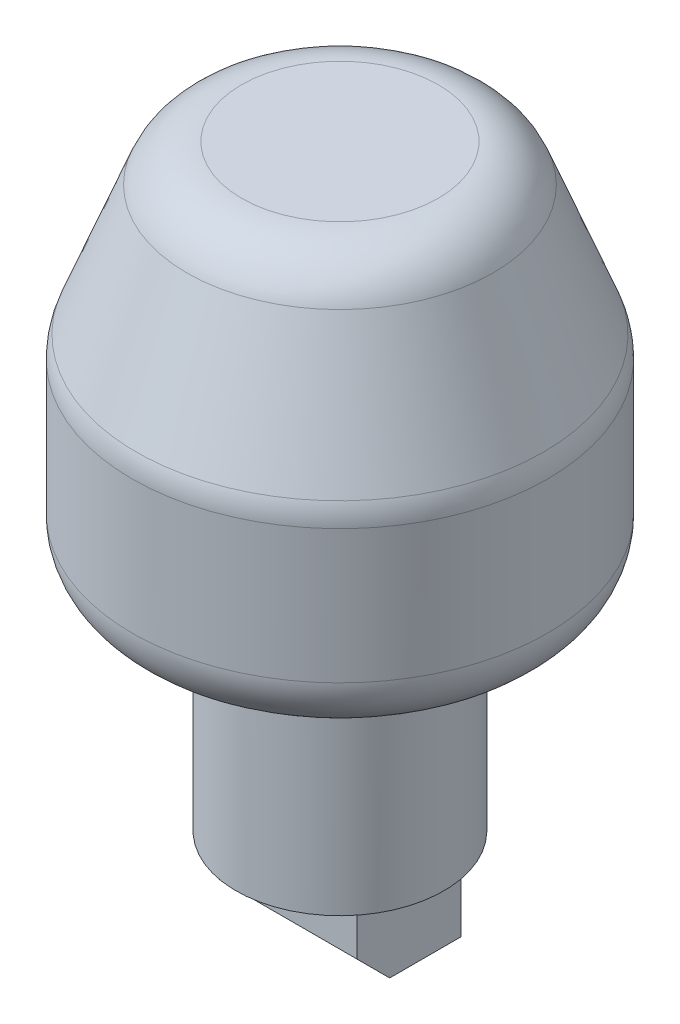
ISO-10303-21;
HEADER;
FILE_DESCRIPTION(('STEP AP214'),'2;1');
FILE_NAME('part.step','',(''),(''),'','','');
FILE_SCHEMA(('AUTOMOTIVE_DESIGN { 1 0 10303 214 1 1 1 1 }'));
ENDSEC;
DATA;
#1=APPLICATION_CONTEXT('core data for automotive mechanical design processes');
#2=APPLICATION_PROTOCOL_DEFINITION('international standard','automotive_design',2000,#1);
#3=PRODUCT_CONTEXT('',#1,'mechanical');
#4=PRODUCT('Part','Part','',(#3));
#5=PRODUCT_RELATED_PRODUCT_CATEGORY('part','',(#4));
#6=PRODUCT_DEFINITION_FORMATION('','',#4);
#7=PRODUCT_DEFINITION_CONTEXT('part definition',#1,'design');
#8=PRODUCT_DEFINITION('design','',#6,#7);
#9=PRODUCT_DEFINITION_SHAPE('','',#8);
#10=(LENGTH_UNIT() NAMED_UNIT(*) SI_UNIT(.MILLI.,.METRE.));
#11=(NAMED_UNIT(*) PLANE_ANGLE_UNIT() SI_UNIT($,.RADIAN.));
#12=(NAMED_UNIT(*) SI_UNIT($,.STERADIAN.) SOLID_ANGLE_UNIT());
#13=UNCERTAINTY_MEASURE_WITH_UNIT(LENGTH_MEASURE(1.E-05),#10,'distance_accuracy_value','');
#14=(GEOMETRIC_REPRESENTATION_CONTEXT(3) GLOBAL_UNCERTAINTY_ASSIGNED_CONTEXT((#13)) GLOBAL_UNIT_ASSIGNED_CONTEXT((#10,
#11,#12)) REPRESENTATION_CONTEXT('',''));
#15=CARTESIAN_POINT('',(0.,0.,0.));
#16=DIRECTION('',(0.,0.,1.));
#17=DIRECTION('',(1.,0.,0.));
#18=AXIS2_PLACEMENT_3D('',#15,#16,#17);
#19=CARTESIAN_POINT('',(7.4549,-9.01718142394338,0.));
#20=DIRECTION('',(0.,-1.,0.));
#21=DIRECTION('',(0.,0.,-1.));
#22=AXIS2_PLACEMENT_3D('',#19,#20,#21);
#23=PLANE('',#22);
#24=DIRECTION('',(0.,0.,1.));
#25=VECTOR('',#24,1.);
#26=CARTESIAN_POINT('',(7.3279,-9.01718142394338,0.));
#27=LINE('',#26,#25);
#28=CARTESIAN_POINT('',(7.3279,-9.01718142394338,-5.49919071197169));
#29=VERTEX_POINT('',#28);
#30=CARTESIAN_POINT('',(7.3279,-9.01718142394338,1.9430092880283));
#31=VERTEX_POINT('',#30);
#32=EDGE_CURVE('E59',#29,#31,#27,.T.);
#33=ORIENTED_EDGE('',*,*,#32,.F.);
#34=DIRECTION('',(1.,0.,0.));
#35=VECTOR('',#34,1.);
#36=CARTESIAN_POINT('',(0.,-9.01718142394338,-5.49919071197169));
#37=LINE('',#36,#35);
#38=CARTESIAN_POINT('',(2.54762,-9.01718142394338,-5.49919071197169));
#39=VERTEX_POINT('',#38);
#40=EDGE_CURVE('E210',#39,#29,#37,.T.);
#41=ORIENTED_EDGE('',*,*,#40,.F.);
#42=DIRECTION('',(0.,0.,-1.));
#43=VECTOR('',#42,1.);
#44=CARTESIAN_POINT('',(2.54762,-9.01718142394338,0.));
#45=LINE('',#44,#43);
#46=CARTESIAN_POINT('',(2.54762,-9.01718142394338,1.94300928802831));
#47=VERTEX_POINT('',#46);
#48=EDGE_CURVE('E225',#47,#39,#45,.T.);
#49=ORIENTED_EDGE('',*,*,#48,.F.);
#50=DIRECTION('',(-1.,0.,0.));
#51=VECTOR('',#50,1.);
#52=CARTESIAN_POINT('',(0.,-9.01718142394338,1.9430092880283));
#53=LINE('',#52,#51);
#54=EDGE_CURVE('E221',#31,#47,#53,.T.);
#55=ORIENTED_EDGE('',*,*,#54,.F.);
#56=EDGE_LOOP('',(#33,#41,#49,#55));
#57=FACE_BOUND('',#56,.T.);
#58=DIRECTION('',(-1.,0.,0.));
#59=VECTOR('',#58,1.);
#60=CARTESIAN_POINT('',(0.,-9.01718142394338,1.9430092880283));
#61=LINE('',#60,#59);
#62=CARTESIAN_POINT('',(-2.54762,-9.01718142394338,1.9430092880283));
#63=VERTEX_POINT('',#62);
#64=CARTESIAN_POINT('',(-7.3279,-9.01718142394338,1.9430092880283));
#65=VERTEX_POINT('',#64);
#66=EDGE_CURVE('E285',#63,#65,#61,.T.);
#67=ORIENTED_EDGE('',*,*,#66,.F.);
#68=DIRECTION('',(0.,0.,-1.));
#69=VECTOR('',#68,1.);
#70=CARTESIAN_POINT('',(-2.54762,-9.01718142394338,0.));
#71=LINE('',#70,#69);
#72=CARTESIAN_POINT('',(-2.54762,-9.01718142394338,-5.49919071197169));
#73=VERTEX_POINT('',#72);
#74=EDGE_CURVE('E263',#63,#73,#71,.T.);
#75=ORIENTED_EDGE('',*,*,#74,.T.);
#76=DIRECTION('',(1.,0.,0.));
#77=VECTOR('',#76,1.);
#78=CARTESIAN_POINT('',(0.,-9.01718142394338,-5.49919071197169));
#79=LINE('',#78,#77);
#80=CARTESIAN_POINT('',(-7.3279,-9.01718142394338,-5.49919071197169));
#81=VERTEX_POINT('',#80);
#82=EDGE_CURVE('E273',#81,#73,#79,.T.);
#83=ORIENTED_EDGE('',*,*,#82,.F.);
#84=DIRECTION('',(0.,0.,-1.));
#85=VECTOR('',#84,1.);
#86=CARTESIAN_POINT('',(-7.3279,-9.01718142394338,0.));
#87=LINE('',#86,#85);
#88=EDGE_CURVE('E288',#65,#81,#87,.T.);
#89=ORIENTED_EDGE('',*,*,#88,.F.);
#90=EDGE_LOOP('',(#67,#75,#83,#89));
#91=FACE_BOUND('',#90,.T.);
#92=DIRECTION('',(0.,0.,1.));
#93=VECTOR('',#92,1.);
#94=CARTESIAN_POINT('',(-7.4549,-9.01718142394338,0.));
#95=LINE('',#94,#93);
#96=CARTESIAN_POINT('',(-7.4549,-9.01718142394338,-5.6261907119717));
#97=VERTEX_POINT('',#96);
#98=CARTESIAN_POINT('',(-7.4549,-9.01718142394338,2.0700092880283));
#99=VERTEX_POINT('',#98);
#100=EDGE_CURVE('E323',#97,#99,#95,.T.);
#101=ORIENTED_EDGE('',*,*,#100,.F.);
#102=DIRECTION('',(-1.,0.,0.));
#103=VECTOR('',#102,1.);
#104=CARTESIAN_POINT('',(7.4549,-9.01718142394338,-5.6261907119717));
#105=LINE('',#104,#103);
#106=CARTESIAN_POINT('',(7.4549,-9.01718142394338,-5.6261907119717));
#107=VERTEX_POINT('',#106);
#108=EDGE_CURVE('E329',#107,#97,#105,.T.);
#109=ORIENTED_EDGE('',*,*,#108,.F.);
#110=DIRECTION('',(0.,0.,1.));
#111=VECTOR('',#110,1.);
#112=CARTESIAN_POINT('',(7.4549,-9.01718142394338,0.));
#113=LINE('',#112,#111);
#114=CARTESIAN_POINT('',(7.4549,-9.01718142394338,2.0700092880283));
#115=VERTEX_POINT('',#114);
#116=EDGE_CURVE('E309',#107,#115,#113,.T.);
#117=ORIENTED_EDGE('',*,*,#116,.T.);
#118=DIRECTION('',(-1.,0.,0.));
#119=VECTOR('',#118,1.);
#120=CARTESIAN_POINT('',(7.4549,-9.01718142394338,2.0700092880283));
#121=LINE('',#120,#119);
#122=EDGE_CURVE('E331',#115,#99,#121,.T.);
#123=ORIENTED_EDGE('',*,*,#122,.T.);
#124=EDGE_LOOP('',(#101,#109,#117,#123));
#125=FACE_BOUND('',#124,.T.);
#126=DIRECTION('',(-1.,0.,0.));
#127=VECTOR('',#126,1.);
#128=CARTESIAN_POINT('',(0.,-9.01718142394338,1.9430092880283));
#129=LINE('',#128,#127);
#130=CARTESIAN_POINT('',(2.42062,-9.01718142394338,1.9430092880283));
#131=VERTEX_POINT('',#130);
#132=CARTESIAN_POINT('',(-2.42062,-9.01718142394338,1.94300928802831));
#133=VERTEX_POINT('',#132);
#134=EDGE_CURVE('E253',#131,#133,#129,.T.);
#135=ORIENTED_EDGE('',*,*,#134,.F.);
#136=DIRECTION('',(0.,0.,-1.));
#137=VECTOR('',#136,1.);
#138=CARTESIAN_POINT('',(2.42062,-9.01718142394338,0.));
#139=LINE('',#138,#137);
#140=CARTESIAN_POINT('',(2.42062,-9.01718142394338,-5.49919071197169));
#141=VERTEX_POINT('',#140);
#142=EDGE_CURVE('E232',#131,#141,#139,.T.);
#143=ORIENTED_EDGE('',*,*,#142,.T.);
#144=DIRECTION('',(1.,0.,0.));
#145=VECTOR('',#144,1.);
#146=CARTESIAN_POINT('',(0.,-9.01718142394338,-5.49919071197169));
#147=LINE('',#146,#145);
#148=CARTESIAN_POINT('',(-2.42062,-9.01718142394338,-5.49919071197169));
#149=VERTEX_POINT('',#148);
#150=EDGE_CURVE('E241',#149,#141,#147,.T.);
#151=ORIENTED_EDGE('',*,*,#150,.F.);
#152=DIRECTION('',(0.,0.,-1.));
#153=VECTOR('',#152,1.);
#154=CARTESIAN_POINT('',(-2.42062,-9.01718142394338,0.));
#155=LINE('',#154,#153);
#156=EDGE_CURVE('E256',#133,#149,#155,.T.);
#157=ORIENTED_EDGE('',*,*,#156,.F.);
#158=EDGE_LOOP('',(#135,#143,#151,#157));
#159=FACE_BOUND('',#158,.T.);
#160=ADVANCED_FACE('F36',(#57,#91,#125,#159),#23,.T.);
#161=CARTESIAN_POINT('',(0.,0.,0.));
#162=DIRECTION('',(0.,1.,0.));
#163=DIRECTION('',(-1.,0.,0.));
#164=AXIS2_PLACEMENT_3D('',#161,#162,#163);
#165=PLANE('',#164);
#166=DIRECTION('',(-1.,0.,0.));
#167=VECTOR('',#166,1.);
#168=CARTESIAN_POINT('',(7.4549,0.,5.62619071197169));
#169=LINE('',#168,#167);
#170=CARTESIAN_POINT('',(7.4549,0.,5.62619071197169));
#171=VERTEX_POINT('',#170);
#172=CARTESIAN_POINT('',(-7.4549,0.,5.62619071197169));
#173=VERTEX_POINT('',#172);
#174=EDGE_CURVE('E336',#171,#173,#169,.T.);
#175=ORIENTED_EDGE('',*,*,#174,.F.);
#176=DIRECTION('',(0.,0.,-1.));
#177=VECTOR('',#176,1.);
#178=CARTESIAN_POINT('',(7.4549,0.,0.));
#179=LINE('',#178,#177);
#180=CARTESIAN_POINT('',(7.4549,0.,-5.62619071197169));
#181=VERTEX_POINT('',#180);
#182=EDGE_CURVE('E302',#171,#181,#179,.T.);
#183=ORIENTED_EDGE('',*,*,#182,.T.);
#184=DIRECTION('',(-1.,0.,0.));
#185=VECTOR('',#184,1.);
#186=CARTESIAN_POINT('',(7.4549,0.,-5.62619071197169));
#187=LINE('',#186,#185);
#188=CARTESIAN_POINT('',(-7.4549,0.,-5.62619071197169));
#189=VERTEX_POINT('',#188);
#190=EDGE_CURVE('E315',#181,#189,#187,.T.);
#191=ORIENTED_EDGE('',*,*,#190,.T.);
#192=DIRECTION('',(0.,0.,-1.));
#193=VECTOR('',#192,1.);
#194=CARTESIAN_POINT('',(-7.4549,0.,0.));
#195=LINE('',#194,#193);
#196=EDGE_CURVE('E295',#173,#189,#195,.T.);
#197=ORIENTED_EDGE('',*,*,#196,.F.);
#198=EDGE_LOOP('',(#175,#183,#191,#197));
#199=FACE_BOUND('',#198,.T.);
#200=CARTESIAN_POINT('',(0.,0.,0.));
#201=DIRECTION('',(0.,1.,0.));
#202=DIRECTION('',(-1.,0.,0.));
#203=AXIS2_PLACEMENT_3D('',#200,#201,#202);
#204=CIRCLE('',#203,11.2395);
#205=CARTESIAN_POINT('',(-11.2395,0.,0.));
#206=VERTEX_POINT('',#205);
#207=EDGE_CURVE('E341',#206,#206,#204,.T.);
#208=ORIENTED_EDGE('',*,*,#207,.F.);
#209=EDGE_LOOP('',(#208));
#210=FACE_BOUND('',#209,.T.);
#211=ADVANCED_FACE('F377',(#199,#210),#165,.F.);
#212=CARTESIAN_POINT('',(0.,64.6193127521161,0.));
#213=DIRECTION('',(0.,1.,0.));
#214=DIRECTION('',(-1.,0.,0.));
#215=AXIS2_PLACEMENT_3D('',#212,#213,#214);
#216=CYLINDRICAL_SURFACE('',#215,11.2395);
#217=CARTESIAN_POINT('',(0.,21.2344,0.));
#218=DIRECTION('',(0.,-1.,0.));
#219=DIRECTION('',(0.,0.,-1.));
#220=AXIS2_PLACEMENT_3D('',#217,#218,#219);
#221=CIRCLE('',#220,11.2395);
#222=CARTESIAN_POINT('',(-1.778,21.2344,11.0979762231679));
#223=VERTEX_POINT('',#222);
#224=CARTESIAN_POINT('',(1.778,21.2344,11.0979762231679));
#225=VERTEX_POINT('',#224);
#226=EDGE_CURVE('E183',#223,#225,#221,.F.);
#227=ORIENTED_EDGE('',*,*,#226,.F.);
#228=DIRECTION('',(0.,1.,0.));
#229=VECTOR('',#228,1.);
#230=CARTESIAN_POINT('',(-1.778,64.6193127521161,11.0979762231679));
#231=LINE('',#230,#229);
#232=CARTESIAN_POINT('',(-1.778,23.4188,11.0979762231679));
#233=VERTEX_POINT('',#232);
#234=EDGE_CURVE('E188',#233,#223,#231,.F.);
#235=ORIENTED_EDGE('',*,*,#234,.F.);
#236=CARTESIAN_POINT('',(0.,23.4188,0.));
#237=DIRECTION('',(0.,1.,0.));
#238=DIRECTION('',(-1.,0.,0.));
#239=AXIS2_PLACEMENT_3D('',#236,#237,#238);
#240=CIRCLE('',#239,11.2395);
#241=CARTESIAN_POINT('',(1.778,23.4188,11.0979762231679));
#242=VERTEX_POINT('',#241);
#243=EDGE_CURVE('E339',#242,#233,#240,.T.);
#244=ORIENTED_EDGE('',*,*,#243,.F.);
#245=DIRECTION('',(0.,1.,0.));
#246=VECTOR('',#245,1.);
#247=CARTESIAN_POINT('',(1.778,64.6193127521161,11.0979762231679));
#248=LINE('',#247,#246);
#249=EDGE_CURVE('E51',#225,#242,#248,.T.);
#250=ORIENTED_EDGE('',*,*,#249,.F.);
#251=EDGE_LOOP('',(#227,#235,#244,#250));
#252=FACE_BOUND('',#251,.T.);
#253=ORIENTED_EDGE('',*,*,#207,.T.);
#254=EDGE_LOOP('',(#253));
#255=FACE_BOUND('',#254,.T.);
#256=ADVANCED_FACE('F198',(#252,#255),#216,.T.);
#257=CARTESIAN_POINT('',(11.2395,23.4188,0.));
#258=DIRECTION('',(0.,1.,0.));
#259=DIRECTION('',(-1.,0.,0.));
#260=AXIS2_PLACEMENT_3D('',#257,#258,#259);
#261=PLANE('',#260);
#262=CARTESIAN_POINT('',(0.,23.4188,0.));
#263=DIRECTION('',(0.,1.,0.));
#264=DIRECTION('',(-1.,0.,0.));
#265=AXIS2_PLACEMENT_3D('',#262,#263,#264);
#266=CIRCLE('',#265,16.123370687632);
#267=CARTESIAN_POINT('',(-16.123370687632,23.4188,0.));
#268=VERTEX_POINT('',#267);
#269=EDGE_CURVE('E350',#268,#268,#266,.F.);
#270=ORIENTED_EDGE('',*,*,#269,.T.);
#271=EDGE_LOOP('',(#270));
#272=FACE_BOUND('',#271,.T.);
#273=ORIENTED_EDGE('',*,*,#243,.T.);
#274=DIRECTION('',(0.,0.,1.));
#275=VECTOR('',#274,1.);
#276=CARTESIAN_POINT('',(-1.778,23.4188,-22.474370687632));
#277=LINE('',#276,#275);
#278=CARTESIAN_POINT('',(-1.778,23.4188,14.29512));
#279=VERTEX_POINT('',#278);
#280=EDGE_CURVE('E193',#233,#279,#277,.T.);
#281=ORIENTED_EDGE('',*,*,#280,.T.);
#282=DIRECTION('',(-1.,0.,0.));
#283=VECTOR('',#282,1.);
#284=CARTESIAN_POINT('',(-1.778,23.4188,14.29512));
#285=LINE('',#284,#283);
#286=CARTESIAN_POINT('',(1.778,23.4188,14.29512));
#287=VERTEX_POINT('',#286);
#288=EDGE_CURVE('E799',#287,#279,#285,.T.);
#289=ORIENTED_EDGE('',*,*,#288,.F.);
#290=DIRECTION('',(0.,0.,1.));
#291=VECTOR('',#290,1.);
#292=CARTESIAN_POINT('',(1.778,23.4188,-22.474370687632));
#293=LINE('',#292,#291);
#294=EDGE_CURVE('E222',#242,#287,#293,.T.);
#295=ORIENTED_EDGE('',*,*,#294,.F.);
#296=EDGE_LOOP('',(#273,#281,#289,#295));
#297=FACE_BOUND('',#296,.T.);
#298=ADVANCED_FACE('F406',(#272,#297),#261,.F.);
#299=CARTESIAN_POINT('',(0.,64.6193127521161,0.));
#300=DIRECTION('',(0.,1.,0.));
#301=DIRECTION('',(-1.,0.,0.));
#302=AXIS2_PLACEMENT_3D('',#299,#300,#301);
#303=CYLINDRICAL_SURFACE('',#302,22.473370687632);
#304=CARTESIAN_POINT('',(0.,29.7688,0.));
#305=DIRECTION('',(0.,1.,0.));
#306=DIRECTION('',(-1.,0.,0.));
#307=AXIS2_PLACEMENT_3D('',#304,#305,#306);
#308=CIRCLE('',#307,22.473370687632);
#309=CARTESIAN_POINT('',(-22.473370687632,29.7688,0.));
#310=VERTEX_POINT('',#309);
#311=EDGE_CURVE('E347',#310,#310,#308,.T.);
#312=ORIENTED_EDGE('',*,*,#311,.T.);
#313=EDGE_LOOP('',(#312));
#314=FACE_BOUND('',#313,.T.);
#315=CARTESIAN_POINT('',(0.,44.2210933640308,0.));
#316=DIRECTION('',(0.,-1.,0.));
#317=DIRECTION('',(1.,0.,0.));
#318=AXIS2_PLACEMENT_3D('',#315,#316,#317);
#319=CIRCLE('',#318,22.473370687632);
#320=CARTESIAN_POINT('',(22.473370687632,44.2210933640308,0.));
#321=VERTEX_POINT('',#320);
#322=EDGE_CURVE('E344',#321,#321,#319,.T.);
#323=ORIENTED_EDGE('',*,*,#322,.T.);
#324=EDGE_LOOP('',(#323));
#325=FACE_BOUND('',#324,.T.);
#326=ADVANCED_FACE('F403',(#314,#325),#303,.T.);
#327=CARTESIAN_POINT('',(0.,45.4152,0.));
#328=DIRECTION('',(0.,-1.,0.));
#329=DIRECTION('',(1.,0.,0.));
#330=AXIS2_PLACEMENT_3D('',#327,#328,#329);
#331=CONICAL_SURFACE('',#330,22.473370687632,0.371755130674789);
#332=CARTESIAN_POINT('',(0.,46.5277386775342,0.));
#333=DIRECTION('',(0.,1.,0.));
#334=DIRECTION('',(-1.,0.,0.));
#335=AXIS2_PLACEMENT_3D('',#332,#333,#334);
#336=CIRCLE('',#335,22.0396099828003);
#337=CARTESIAN_POINT('',(-22.0396099828003,46.5277386775342,0.));
#338=VERTEX_POINT('',#337);
#339=EDGE_CURVE('E44',#338,#338,#336,.T.);
#340=ORIENTED_EDGE('',*,*,#339,.T.);
#341=EDGE_LOOP('',(#340));
#342=FACE_BOUND('',#341,.T.);
#343=CARTESIAN_POINT('',(0.,60.5759580656195,0.));
#344=DIRECTION('',(0.,1.,0.));
#345=DIRECTION('',(-1.,0.,0.));
#346=AXIS2_PLACEMENT_3D('',#343,#344,#345);
#347=CIRCLE('',#346,16.5624381177172);
#348=CARTESIAN_POINT('',(-16.5624381177172,60.5759580656195,0.));
#349=VERTEX_POINT('',#348);
#350=EDGE_CURVE('E353',#349,#349,#347,.F.);
#351=ORIENTED_EDGE('',*,*,#350,.T.);
#352=EDGE_LOOP('',(#351));
#353=FACE_BOUND('',#352,.T.);
#354=ADVANCED_FACE('F358',(#342,#353),#331,.T.);
#355=CARTESIAN_POINT('',(14.986,64.6193127521161,0.));
#356=DIRECTION('',(0.,-1.,0.));
#357=DIRECTION('',(1.,0.,0.));
#358=AXIS2_PLACEMENT_3D('',#355,#356,#357);
#359=PLANE('',#358);
#360=CARTESIAN_POINT('',(0.,64.6193127521161,0.));
#361=DIRECTION('',(0.,-1.,0.));
#362=DIRECTION('',(1.,0.,0.));
#363=AXIS2_PLACEMENT_3D('',#360,#361,#362);
#364=CIRCLE('',#363,10.6461988225489);
#365=CARTESIAN_POINT('',(10.6461988225489,64.6193127521161,0.));
#366=VERTEX_POINT('',#365);
#367=EDGE_CURVE('E11',#366,#366,#364,.F.);
#368=ORIENTED_EDGE('',*,*,#367,.T.);
#369=EDGE_LOOP('',(#368));
#370=FACE_BOUND('',#369,.T.);
#371=ADVANCED_FACE('F372',(#370),#359,.F.);
#372=CARTESIAN_POINT('',(0.,29.7688,0.));
#373=DIRECTION('',(0.,1.,0.));
#374=DIRECTION('',(-1.,0.,0.));
#375=AXIS2_PLACEMENT_3D('',#372,#373,#374);
#376=TOROIDAL_SURFACE('',#375,16.123370687632,6.35);
#377=ORIENTED_EDGE('',*,*,#269,.F.);
#378=EDGE_LOOP('',(#377));
#379=FACE_BOUND('',#378,.T.);
#380=ORIENTED_EDGE('',*,*,#311,.F.);
#381=EDGE_LOOP('',(#380));
#382=FACE_BOUND('',#381,.T.);
#383=ADVANCED_FACE('F363',(#379,#382),#376,.T.);
#384=CARTESIAN_POINT('',(0.,44.2210933640308,0.));
#385=DIRECTION('',(0.,-1.,0.));
#386=DIRECTION('',(1.,0.,0.));
#387=AXIS2_PLACEMENT_3D('',#384,#385,#386);
#388=TOROIDAL_SURFACE('',#387,16.123370687632,6.35);
#389=ORIENTED_EDGE('',*,*,#322,.F.);
#390=EDGE_LOOP('',(#389));
#391=FACE_BOUND('',#390,.T.);
#392=ORIENTED_EDGE('',*,*,#339,.F.);
#393=EDGE_LOOP('',(#392));
#394=FACE_BOUND('',#393,.T.);
#395=ADVANCED_FACE('F361',(#391,#394),#388,.T.);
#396=CARTESIAN_POINT('',(0.,58.2693127521161,0.));
#397=DIRECTION('',(0.,-1.,0.));
#398=DIRECTION('',(1.,0.,0.));
#399=AXIS2_PLACEMENT_3D('',#396,#397,#398);
#400=TOROIDAL_SURFACE('',#399,10.6461988225489,6.35);
#401=ORIENTED_EDGE('',*,*,#350,.F.);
#402=EDGE_LOOP('',(#401));
#403=FACE_BOUND('',#402,.T.);
#404=ORIENTED_EDGE('',*,*,#367,.F.);
#405=EDGE_LOOP('',(#404));
#406=FACE_BOUND('',#405,.T.);
#407=ADVANCED_FACE('F38',(#403,#406),#400,.T.);
#408=CARTESIAN_POINT('',(7.4549,0.,5.62619071197169));
#409=DIRECTION('',(0.,0.,-1.));
#410=DIRECTION('',(0.,1.,0.));
#411=AXIS2_PLACEMENT_3D('',#408,#409,#410);
#412=PLANE('',#411);
#413=DIRECTION('',(0.,-1.,0.));
#414=VECTOR('',#413,1.);
#415=CARTESIAN_POINT('',(-7.4549,0.,5.62619071197169));
#416=LINE('',#415,#414);
#417=CARTESIAN_POINT('',(-7.4549,-5.461,5.62619071197169));
#418=VERTEX_POINT('',#417);
#419=EDGE_CURVE('E318',#173,#418,#416,.T.);
#420=ORIENTED_EDGE('',*,*,#419,.T.);
#421=DIRECTION('',(-1.,0.,0.));
#422=VECTOR('',#421,1.);
#423=CARTESIAN_POINT('',(7.4549,-5.461,5.62619071197169));
#424=LINE('',#423,#422);
#425=CARTESIAN_POINT('',(7.4549,-5.461,5.62619071197169));
#426=VERTEX_POINT('',#425);
#427=EDGE_CURVE('E333',#426,#418,#424,.T.);
#428=ORIENTED_EDGE('',*,*,#427,.F.);
#429=DIRECTION('',(0.,-1.,0.));
#430=VECTOR('',#429,1.);
#431=CARTESIAN_POINT('',(7.4549,0.,5.62619071197169));
#432=LINE('',#431,#430);
#433=EDGE_CURVE('E304',#171,#426,#432,.T.);
#434=ORIENTED_EDGE('',*,*,#433,.F.);
#435=ORIENTED_EDGE('',*,*,#174,.T.);
#436=EDGE_LOOP('',(#420,#428,#434,#435));
#437=FACE_BOUND('',#436,.T.);
#438=ADVANCED_FACE('F369',(#437),#412,.F.);
#439=CARTESIAN_POINT('',(7.4549,-5.54359535598586,5.54359535598584));
#440=DIRECTION('',(0.,0.707106781186549,-0.707106781186546));
#441=DIRECTION('',(0.,0.707106781186546,0.707106781186549));
#442=AXIS2_PLACEMENT_3D('',#439,#440,#441);
#443=PLANE('',#442);
#444=DIRECTION('',(0.,-0.707106781186546,-0.707106781186549));
#445=VECTOR('',#444,1.);
#446=CARTESIAN_POINT('',(-7.4549,-5.54359535598586,5.54359535598584));
#447=LINE('',#446,#445);
#448=EDGE_CURVE('E320',#418,#99,#447,.T.);
#449=ORIENTED_EDGE('',*,*,#448,.T.);
#450=ORIENTED_EDGE('',*,*,#122,.F.);
#451=DIRECTION('',(0.,-0.707106781186546,-0.707106781186549));
#452=VECTOR('',#451,1.);
#453=CARTESIAN_POINT('',(7.4549,-5.54359535598586,5.54359535598584));
#454=LINE('',#453,#452);
#455=EDGE_CURVE('E307',#426,#115,#454,.T.);
#456=ORIENTED_EDGE('',*,*,#455,.F.);
#457=ORIENTED_EDGE('',*,*,#427,.T.);
#458=EDGE_LOOP('',(#449,#450,#456,#457));
#459=FACE_BOUND('',#458,.T.);
#460=ADVANCED_FACE('F391',(#459),#443,.F.);
#461=CARTESIAN_POINT('',(7.4549,0.,-5.62619071197169));
#462=DIRECTION('',(0.,0.,-1.));
#463=DIRECTION('',(0.,1.,0.));
#464=AXIS2_PLACEMENT_3D('',#461,#462,#463);
#465=PLANE('',#464);
#466=DIRECTION('',(0.,-1.,0.));
#467=VECTOR('',#466,1.);
#468=CARTESIAN_POINT('',(-7.4549,0.,-5.62619071197169));
#469=LINE('',#468,#467);
#470=EDGE_CURVE('E305',#189,#97,#469,.T.);
#471=ORIENTED_EDGE('',*,*,#470,.F.);
#472=ORIENTED_EDGE('',*,*,#190,.F.);
#473=DIRECTION('',(0.,-1.,0.));
#474=VECTOR('',#473,1.);
#475=CARTESIAN_POINT('',(7.4549,0.,-5.62619071197169));
#476=LINE('',#475,#474);
#477=EDGE_CURVE('E312',#181,#107,#476,.T.);
#478=ORIENTED_EDGE('',*,*,#477,.T.);
#479=ORIENTED_EDGE('',*,*,#108,.T.);
#480=EDGE_LOOP('',(#471,#472,#478,#479));
#481=FACE_BOUND('',#480,.T.);
#482=ADVANCED_FACE('F389',(#481),#465,.T.);
#483=CARTESIAN_POINT('',(7.4549,0.,0.));
#484=DIRECTION('',(1.,0.,0.));
#485=DIRECTION('',(0.,0.,-1.));
#486=AXIS2_PLACEMENT_3D('',#483,#484,#485);
#487=PLANE('',#486);
#488=ORIENTED_EDGE('',*,*,#182,.F.);
#489=ORIENTED_EDGE('',*,*,#433,.T.);
#490=ORIENTED_EDGE('',*,*,#455,.T.);
#491=ORIENTED_EDGE('',*,*,#116,.F.);
#492=ORIENTED_EDGE('',*,*,#477,.F.);
#493=EDGE_LOOP('',(#488,#489,#490,#491,#492));
#494=FACE_BOUND('',#493,.T.);
#495=ADVANCED_FACE('F426',(#494),#487,.T.);
#496=CARTESIAN_POINT('',(-7.4549,0.,0.));
#497=DIRECTION('',(1.,0.,0.));
#498=DIRECTION('',(0.,0.,-1.));
#499=AXIS2_PLACEMENT_3D('',#496,#497,#498);
#500=PLANE('',#499);
#501=ORIENTED_EDGE('',*,*,#196,.T.);
#502=ORIENTED_EDGE('',*,*,#470,.T.);
#503=ORIENTED_EDGE('',*,*,#100,.T.);
#504=ORIENTED_EDGE('',*,*,#448,.F.);
#505=ORIENTED_EDGE('',*,*,#419,.F.);
#506=EDGE_LOOP('',(#501,#502,#503,#504,#505));
#507=FACE_BOUND('',#506,.T.);
#508=ADVANCED_FACE('F430',(#507),#500,.F.);
#509=CARTESIAN_POINT('',(-2.54762,-6.47718142394338,0.));
#510=DIRECTION('',(-1.,0.,0.));
#511=DIRECTION('',(0.,0.,1.));
#512=AXIS2_PLACEMENT_3D('',#509,#510,#511);
#513=PLANE('',#512);
#514=ORIENTED_EDGE('',*,*,#74,.F.);
#515=DIRECTION('',(0.,-1.,0.));
#516=VECTOR('',#515,1.);
#517=CARTESIAN_POINT('',(-2.54762,-6.47718142394338,1.94300928802831));
#518=LINE('',#517,#516);
#519=CARTESIAN_POINT('',(-2.54762,-6.47718142394338,1.94300928802831));
#520=VERTEX_POINT('',#519);
#521=EDGE_CURVE('E282',#520,#63,#518,.T.);
#522=ORIENTED_EDGE('',*,*,#521,.F.);
#523=DIRECTION('',(0.,0.,-1.));
#524=VECTOR('',#523,1.);
#525=CARTESIAN_POINT('',(-2.54762,-6.47718142394338,0.));
#526=LINE('',#525,#524);
#527=CARTESIAN_POINT('',(-2.54762,-6.47718142394338,-5.49919071197169));
#528=VERTEX_POINT('',#527);
#529=EDGE_CURVE('E270',#520,#528,#526,.T.);
#530=ORIENTED_EDGE('',*,*,#529,.T.);
#531=DIRECTION('',(0.,-1.,0.));
#532=VECTOR('',#531,1.);
#533=CARTESIAN_POINT('',(-2.54762,-6.47718142394338,-5.49919071197169));
#534=LINE('',#533,#532);
#535=EDGE_CURVE('E293',#528,#73,#534,.T.);
#536=ORIENTED_EDGE('',*,*,#535,.T.);
#537=EDGE_LOOP('',(#514,#522,#530,#536));
#538=FACE_BOUND('',#537,.T.);
#539=ADVANCED_FACE('F444',(#538),#513,.T.);
#540=CARTESIAN_POINT('',(0.,-6.47718142394338,-5.49919071197169));
#541=DIRECTION('',(0.,0.,-1.));
#542=DIRECTION('',(0.,1.,0.));
#543=AXIS2_PLACEMENT_3D('',#540,#541,#542);
#544=PLANE('',#543);
#545=ORIENTED_EDGE('',*,*,#82,.T.);
#546=ORIENTED_EDGE('',*,*,#535,.F.);
#547=DIRECTION('',(1.,0.,0.));
#548=VECTOR('',#547,1.);
#549=CARTESIAN_POINT('',(0.,-6.47718142394338,-5.49919071197169));
#550=LINE('',#549,#548);
#551=CARTESIAN_POINT('',(-7.3279,-6.47718142394338,-5.49919071197169));
#552=VERTEX_POINT('',#551);
#553=EDGE_CURVE('E279',#552,#528,#550,.T.);
#554=ORIENTED_EDGE('',*,*,#553,.F.);
#555=DIRECTION('',(0.,-1.,0.));
#556=VECTOR('',#555,1.);
#557=CARTESIAN_POINT('',(-7.3279,-6.47718142394338,-5.49919071197169));
#558=LINE('',#557,#556);
#559=EDGE_CURVE('E296',#552,#81,#558,.T.);
#560=ORIENTED_EDGE('',*,*,#559,.T.);
#561=EDGE_LOOP('',(#545,#546,#554,#560));
#562=FACE_BOUND('',#561,.T.);
#563=ADVANCED_FACE('F652',(#562),#544,.F.);
#564=CARTESIAN_POINT('',(-7.3279,-6.47718142394338,0.));
#565=DIRECTION('',(-1.,0.,0.));
#566=DIRECTION('',(0.,0.,1.));
#567=AXIS2_PLACEMENT_3D('',#564,#565,#566);
#568=PLANE('',#567);
#569=ORIENTED_EDGE('',*,*,#88,.T.);
#570=ORIENTED_EDGE('',*,*,#559,.F.);
#571=DIRECTION('',(0.,0.,-1.));
#572=VECTOR('',#571,1.);
#573=CARTESIAN_POINT('',(-7.3279,-6.47718142394338,0.));
#574=LINE('',#573,#572);
#575=CARTESIAN_POINT('',(-7.3279,-6.47718142394338,1.94300928802831));
#576=VERTEX_POINT('',#575);
#577=EDGE_CURVE('E276',#576,#552,#574,.T.);
#578=ORIENTED_EDGE('',*,*,#577,.F.);
#579=DIRECTION('',(0.,-1.,0.));
#580=VECTOR('',#579,1.);
#581=CARTESIAN_POINT('',(-7.3279,-6.47718142394338,1.94300928802831));
#582=LINE('',#581,#580);
#583=EDGE_CURVE('E298',#576,#65,#582,.T.);
#584=ORIENTED_EDGE('',*,*,#583,.T.);
#585=EDGE_LOOP('',(#569,#570,#578,#584));
#586=FACE_BOUND('',#585,.T.);
#587=ADVANCED_FACE('F642',(#586),#568,.F.);
#588=CARTESIAN_POINT('',(0.,-6.47718142394338,1.94300928802831));
#589=DIRECTION('',(0.,0.,1.));
#590=DIRECTION('',(0.,-1.,0.));
#591=AXIS2_PLACEMENT_3D('',#588,#589,#590);
#592=PLANE('',#591);
#593=ORIENTED_EDGE('',*,*,#66,.T.);
#594=ORIENTED_EDGE('',*,*,#583,.F.);
#595=DIRECTION('',(-1.,0.,0.));
#596=VECTOR('',#595,1.);
#597=CARTESIAN_POINT('',(0.,-6.47718142394338,1.94300928802831));
#598=LINE('',#597,#596);
#599=EDGE_CURVE('E272',#520,#576,#598,.T.);
#600=ORIENTED_EDGE('',*,*,#599,.F.);
#601=ORIENTED_EDGE('',*,*,#521,.T.);
#602=EDGE_LOOP('',(#593,#594,#600,#601));
#603=FACE_BOUND('',#602,.T.);
#604=ADVANCED_FACE('F631',(#603),#592,.F.);
#605=CARTESIAN_POINT('',(0.,-6.47718142394338,0.));
#606=DIRECTION('',(0.,-1.,0.));
#607=DIRECTION('',(0.,0.,-1.));
#608=AXIS2_PLACEMENT_3D('',#605,#606,#607);
#609=PLANE('',#608);
#610=ORIENTED_EDGE('',*,*,#529,.F.);
#611=ORIENTED_EDGE('',*,*,#599,.T.);
#612=ORIENTED_EDGE('',*,*,#577,.T.);
#613=ORIENTED_EDGE('',*,*,#553,.T.);
#614=EDGE_LOOP('',(#610,#611,#612,#613));
#615=FACE_BOUND('',#614,.T.);
#616=ADVANCED_FACE('F619',(#615),#609,.T.);
#617=CARTESIAN_POINT('',(2.42062,-6.47718142394338,0.));
#618=DIRECTION('',(-1.,0.,0.));
#619=DIRECTION('',(0.,0.,1.));
#620=AXIS2_PLACEMENT_3D('',#617,#618,#619);
#621=PLANE('',#620);
#622=ORIENTED_EDGE('',*,*,#142,.F.);
#623=DIRECTION('',(0.,-1.,0.));
#624=VECTOR('',#623,1.);
#625=CARTESIAN_POINT('',(2.42062,-6.47718142394338,1.94300928802831));
#626=LINE('',#625,#624);
#627=CARTESIAN_POINT('',(2.42062,-6.47718142394338,1.94300928802831));
#628=VERTEX_POINT('',#627);
#629=EDGE_CURVE('E250',#628,#131,#626,.T.);
#630=ORIENTED_EDGE('',*,*,#629,.F.);
#631=DIRECTION('',(0.,0.,-1.));
#632=VECTOR('',#631,1.);
#633=CARTESIAN_POINT('',(2.42062,-6.47718142394338,0.));
#634=LINE('',#633,#632);
#635=CARTESIAN_POINT('',(2.42062,-6.47718142394338,-5.49919071197169));
#636=VERTEX_POINT('',#635);
#637=EDGE_CURVE('E238',#628,#636,#634,.T.);
#638=ORIENTED_EDGE('',*,*,#637,.T.);
#639=DIRECTION('',(0.,-1.,0.));
#640=VECTOR('',#639,1.);
#641=CARTESIAN_POINT('',(2.42062,-6.47718142394338,-5.49919071197169));
#642=LINE('',#641,#640);
#643=EDGE_CURVE('E261',#636,#141,#642,.T.);
#644=ORIENTED_EDGE('',*,*,#643,.T.);
#645=EDGE_LOOP('',(#622,#630,#638,#644));
#646=FACE_BOUND('',#645,.T.);
#647=ADVANCED_FACE('F609',(#646),#621,.T.);
#648=CARTESIAN_POINT('',(0.,-6.47718142394338,-5.49919071197169));
#649=DIRECTION('',(0.,0.,-1.));
#650=DIRECTION('',(0.,1.,0.));
#651=AXIS2_PLACEMENT_3D('',#648,#649,#650);
#652=PLANE('',#651);
#653=ORIENTED_EDGE('',*,*,#150,.T.);
#654=ORIENTED_EDGE('',*,*,#643,.F.);
#655=DIRECTION('',(1.,0.,0.));
#656=VECTOR('',#655,1.);
#657=CARTESIAN_POINT('',(0.,-6.47718142394338,-5.49919071197169));
#658=LINE('',#657,#656);
#659=CARTESIAN_POINT('',(-2.42062,-6.47718142394338,-5.49919071197169));
#660=VERTEX_POINT('',#659);
#661=EDGE_CURVE('E247',#660,#636,#658,.T.);
#662=ORIENTED_EDGE('',*,*,#661,.F.);
#663=DIRECTION('',(0.,-1.,0.));
#664=VECTOR('',#663,1.);
#665=CARTESIAN_POINT('',(-2.42062,-6.47718142394338,-5.49919071197169));
#666=LINE('',#665,#664);
#667=EDGE_CURVE('E264',#660,#149,#666,.T.);
#668=ORIENTED_EDGE('',*,*,#667,.T.);
#669=EDGE_LOOP('',(#653,#654,#662,#668));
#670=FACE_BOUND('',#669,.T.);
#671=ADVANCED_FACE('F599',(#670),#652,.F.);
#672=CARTESIAN_POINT('',(-2.42062,-6.47718142394338,0.));
#673=DIRECTION('',(-1.,0.,0.));
#674=DIRECTION('',(0.,0.,1.));
#675=AXIS2_PLACEMENT_3D('',#672,#673,#674);
#676=PLANE('',#675);
#677=ORIENTED_EDGE('',*,*,#156,.T.);
#678=ORIENTED_EDGE('',*,*,#667,.F.);
#679=DIRECTION('',(0.,0.,-1.));
#680=VECTOR('',#679,1.);
#681=CARTESIAN_POINT('',(-2.42062,-6.47718142394338,0.));
#682=LINE('',#681,#680);
#683=CARTESIAN_POINT('',(-2.42062,-6.47718142394338,1.94300928802831));
#684=VERTEX_POINT('',#683);
#685=EDGE_CURVE('E244',#684,#660,#682,.T.);
#686=ORIENTED_EDGE('',*,*,#685,.F.);
#687=DIRECTION('',(0.,-1.,0.));
#688=VECTOR('',#687,1.);
#689=CARTESIAN_POINT('',(-2.42062,-6.47718142394338,1.94300928802831));
#690=LINE('',#689,#688);
#691=EDGE_CURVE('E266',#684,#133,#690,.T.);
#692=ORIENTED_EDGE('',*,*,#691,.T.);
#693=EDGE_LOOP('',(#677,#678,#686,#692));
#694=FACE_BOUND('',#693,.T.);
#695=ADVANCED_FACE('F588',(#694),#676,.F.);
#696=CARTESIAN_POINT('',(0.,-6.47718142394338,1.94300928802831));
#697=DIRECTION('',(0.,0.,1.));
#698=DIRECTION('',(0.,-1.,0.));
#699=AXIS2_PLACEMENT_3D('',#696,#697,#698);
#700=PLANE('',#699);
#701=ORIENTED_EDGE('',*,*,#134,.T.);
#702=ORIENTED_EDGE('',*,*,#691,.F.);
#703=DIRECTION('',(-1.,0.,0.));
#704=VECTOR('',#703,1.);
#705=CARTESIAN_POINT('',(0.,-6.47718142394338,1.94300928802831));
#706=LINE('',#705,#704);
#707=EDGE_CURVE('E240',#628,#684,#706,.T.);
#708=ORIENTED_EDGE('',*,*,#707,.F.);
#709=ORIENTED_EDGE('',*,*,#629,.T.);
#710=EDGE_LOOP('',(#701,#702,#708,#709));
#711=FACE_BOUND('',#710,.T.);
#712=ADVANCED_FACE('F578',(#711),#700,.F.);
#713=CARTESIAN_POINT('',(0.,-6.47718142394338,0.));
#714=DIRECTION('',(0.,-1.,0.));
#715=DIRECTION('',(0.,0.,-1.));
#716=AXIS2_PLACEMENT_3D('',#713,#714,#715);
#717=PLANE('',#716);
#718=ORIENTED_EDGE('',*,*,#637,.F.);
#719=ORIENTED_EDGE('',*,*,#707,.T.);
#720=ORIENTED_EDGE('',*,*,#685,.T.);
#721=ORIENTED_EDGE('',*,*,#661,.T.);
#722=EDGE_LOOP('',(#718,#719,#720,#721));
#723=FACE_BOUND('',#722,.T.);
#724=ADVANCED_FACE('F568',(#723),#717,.T.);
#725=CARTESIAN_POINT('',(7.3279,-6.47718142394338,0.));
#726=DIRECTION('',(1.,0.,0.));
#727=DIRECTION('',(0.,0.,-1.));
#728=AXIS2_PLACEMENT_3D('',#725,#726,#727);
#729=PLANE('',#728);
#730=ORIENTED_EDGE('',*,*,#32,.T.);
#731=DIRECTION('',(0.,-1.,0.));
#732=VECTOR('',#731,1.);
#733=CARTESIAN_POINT('',(7.3279,-6.47718142394338,1.94300928802831));
#734=LINE('',#733,#732);
#735=CARTESIAN_POINT('',(7.3279,-6.47718142394338,1.94300928802831));
#736=VERTEX_POINT('',#735);
#737=EDGE_CURVE('E219',#736,#31,#734,.T.);
#738=ORIENTED_EDGE('',*,*,#737,.F.);
#739=DIRECTION('',(0.,0.,1.));
#740=VECTOR('',#739,1.);
#741=CARTESIAN_POINT('',(7.3279,-6.47718142394338,0.));
#742=LINE('',#741,#740);
#743=CARTESIAN_POINT('',(7.3279,-6.47718142394338,-5.49919071197169));
#744=VERTEX_POINT('',#743);
#745=EDGE_CURVE('E206',#744,#736,#742,.T.);
#746=ORIENTED_EDGE('',*,*,#745,.F.);
#747=DIRECTION('',(0.,-1.,0.));
#748=VECTOR('',#747,1.);
#749=CARTESIAN_POINT('',(7.3279,-6.47718142394338,-5.49919071197169));
#750=LINE('',#749,#748);
#751=EDGE_CURVE('E230',#744,#29,#750,.T.);
#752=ORIENTED_EDGE('',*,*,#751,.T.);
#753=EDGE_LOOP('',(#730,#738,#746,#752));
#754=FACE_BOUND('',#753,.T.);
#755=ADVANCED_FACE('F557',(#754),#729,.F.);
#756=CARTESIAN_POINT('',(0.,-6.47718142394338,-5.49919071197169));
#757=DIRECTION('',(0.,0.,-1.));
#758=DIRECTION('',(0.,1.,0.));
#759=AXIS2_PLACEMENT_3D('',#756,#757,#758);
#760=PLANE('',#759);
#761=ORIENTED_EDGE('',*,*,#40,.T.);
#762=ORIENTED_EDGE('',*,*,#751,.F.);
#763=DIRECTION('',(1.,0.,0.));
#764=VECTOR('',#763,1.);
#765=CARTESIAN_POINT('',(0.,-6.47718142394338,-5.49919071197169));
#766=LINE('',#765,#764);
#767=CARTESIAN_POINT('',(2.54762,-6.47718142394338,-5.49919071197169));
#768=VERTEX_POINT('',#767);
#769=EDGE_CURVE('E216',#768,#744,#766,.T.);
#770=ORIENTED_EDGE('',*,*,#769,.F.);
#771=DIRECTION('',(0.,-1.,0.));
#772=VECTOR('',#771,1.);
#773=CARTESIAN_POINT('',(2.54762,-6.47718142394338,-5.49919071197169));
#774=LINE('',#773,#772);
#775=EDGE_CURVE('E233',#768,#39,#774,.T.);
#776=ORIENTED_EDGE('',*,*,#775,.T.);
#777=EDGE_LOOP('',(#761,#762,#770,#776));
#778=FACE_BOUND('',#777,.T.);
#779=ADVANCED_FACE('F544',(#778),#760,.F.);
#780=CARTESIAN_POINT('',(2.54762,-6.47718142394338,0.));
#781=DIRECTION('',(-1.,0.,0.));
#782=DIRECTION('',(0.,0.,1.));
#783=AXIS2_PLACEMENT_3D('',#780,#781,#782);
#784=PLANE('',#783);
#785=ORIENTED_EDGE('',*,*,#48,.T.);
#786=ORIENTED_EDGE('',*,*,#775,.F.);
#787=DIRECTION('',(0.,0.,-1.));
#788=VECTOR('',#787,1.);
#789=CARTESIAN_POINT('',(2.54762,-6.47718142394338,0.));
#790=LINE('',#789,#788);
#791=CARTESIAN_POINT('',(2.54762,-6.47718142394338,1.94300928802831));
#792=VERTEX_POINT('',#791);
#793=EDGE_CURVE('E213',#792,#768,#790,.T.);
#794=ORIENTED_EDGE('',*,*,#793,.F.);
#795=DIRECTION('',(0.,-1.,0.));
#796=VECTOR('',#795,1.);
#797=CARTESIAN_POINT('',(2.54762,-6.47718142394338,1.94300928802831));
#798=LINE('',#797,#796);
#799=EDGE_CURVE('E235',#792,#47,#798,.T.);
#800=ORIENTED_EDGE('',*,*,#799,.T.);
#801=EDGE_LOOP('',(#785,#786,#794,#800));
#802=FACE_BOUND('',#801,.T.);
#803=ADVANCED_FACE('F531',(#802),#784,.F.);
#804=CARTESIAN_POINT('',(0.,-6.47718142394338,1.94300928802831));
#805=DIRECTION('',(0.,0.,1.));
#806=DIRECTION('',(0.,-1.,0.));
#807=AXIS2_PLACEMENT_3D('',#804,#805,#806);
#808=PLANE('',#807);
#809=ORIENTED_EDGE('',*,*,#54,.T.);
#810=ORIENTED_EDGE('',*,*,#799,.F.);
#811=DIRECTION('',(-1.,0.,0.));
#812=VECTOR('',#811,1.);
#813=CARTESIAN_POINT('',(0.,-6.47718142394338,1.94300928802831));
#814=LINE('',#813,#812);
#815=EDGE_CURVE('E209',#736,#792,#814,.T.);
#816=ORIENTED_EDGE('',*,*,#815,.F.);
#817=ORIENTED_EDGE('',*,*,#737,.T.);
#818=EDGE_LOOP('',(#809,#810,#816,#817));
#819=FACE_BOUND('',#818,.T.);
#820=ADVANCED_FACE('F518',(#819),#808,.F.);
#821=CARTESIAN_POINT('',(0.,-6.47718142394338,0.));
#822=DIRECTION('',(0.,-1.,0.));
#823=DIRECTION('',(0.,0.,-1.));
#824=AXIS2_PLACEMENT_3D('',#821,#822,#823);
#825=PLANE('',#824);
#826=ORIENTED_EDGE('',*,*,#745,.T.);
#827=ORIENTED_EDGE('',*,*,#815,.T.);
#828=ORIENTED_EDGE('',*,*,#793,.T.);
#829=ORIENTED_EDGE('',*,*,#769,.T.);
#830=EDGE_LOOP('',(#826,#827,#828,#829));
#831=FACE_BOUND('',#830,.T.);
#832=ADVANCED_FACE('F475',(#831),#825,.T.);
#833=CARTESIAN_POINT('',(0.,0.,14.29512));
#834=DIRECTION('',(0.,0.,-1.));
#835=DIRECTION('',(-1.,0.,0.));
#836=AXIS2_PLACEMENT_3D('',#833,#834,#835);
#837=PLANE('',#836);
#838=DIRECTION('',(0.,1.,0.));
#839=VECTOR('',#838,1.);
#840=CARTESIAN_POINT('',(1.778,21.2344,14.29512));
#841=LINE('',#840,#839);
#842=CARTESIAN_POINT('',(1.778,21.2344,14.29512));
#843=VERTEX_POINT('',#842);
#844=EDGE_CURVE('E796',#843,#287,#841,.T.);
#845=ORIENTED_EDGE('',*,*,#844,.T.);
#846=ORIENTED_EDGE('',*,*,#288,.T.);
#847=DIRECTION('',(0.,-1.,0.));
#848=VECTOR('',#847,1.);
#849=CARTESIAN_POINT('',(-1.778,21.2344,14.29512));
#850=LINE('',#849,#848);
#851=CARTESIAN_POINT('',(-1.778,21.2344,14.29512));
#852=VERTEX_POINT('',#851);
#853=EDGE_CURVE('E801',#279,#852,#850,.T.);
#854=ORIENTED_EDGE('',*,*,#853,.T.);
#855=DIRECTION('',(1.,0.,0.));
#856=VECTOR('',#855,1.);
#857=CARTESIAN_POINT('',(-1.778,21.2344,14.29512));
#858=LINE('',#857,#856);
#859=EDGE_CURVE('E185',#852,#843,#858,.T.);
#860=ORIENTED_EDGE('',*,*,#859,.T.);
#861=EDGE_LOOP('',(#845,#846,#854,#860));
#862=FACE_BOUND('',#861,.T.);
#863=ADVANCED_FACE('F460',(#862),#837,.F.);
#864=CARTESIAN_POINT('',(-1.778,21.2344,-22.474370687632));
#865=DIRECTION('',(-1.,0.,0.));
#866=DIRECTION('',(0.,0.,1.));
#867=AXIS2_PLACEMENT_3D('',#864,#865,#866);
#868=PLANE('',#867);
#869=ORIENTED_EDGE('',*,*,#280,.F.);
#870=ORIENTED_EDGE('',*,*,#234,.T.);
#871=DIRECTION('',(0.,0.,1.));
#872=VECTOR('',#871,1.);
#873=CARTESIAN_POINT('',(-1.778,21.2344,-22.474370687632));
#874=LINE('',#873,#872);
#875=EDGE_CURVE('E179',#223,#852,#874,.T.);
#876=ORIENTED_EDGE('',*,*,#875,.T.);
#877=ORIENTED_EDGE('',*,*,#853,.F.);
#878=EDGE_LOOP('',(#869,#870,#876,#877));
#879=FACE_BOUND('',#878,.T.);
#880=ADVANCED_FACE('F191',(#879),#868,.T.);
#881=CARTESIAN_POINT('',(-1.778,21.2344,-22.474370687632));
#882=DIRECTION('',(0.,-1.,0.));
#883=DIRECTION('',(0.,0.,-1.));
#884=AXIS2_PLACEMENT_3D('',#881,#882,#883);
#885=PLANE('',#884);
#886=ORIENTED_EDGE('',*,*,#875,.F.);
#887=ORIENTED_EDGE('',*,*,#226,.T.);
#888=DIRECTION('',(0.,0.,1.));
#889=VECTOR('',#888,1.);
#890=CARTESIAN_POINT('',(1.778,21.2344,-22.474370687632));
#891=LINE('',#890,#889);
#892=EDGE_CURVE('E200',#225,#843,#891,.T.);
#893=ORIENTED_EDGE('',*,*,#892,.T.);
#894=ORIENTED_EDGE('',*,*,#859,.F.);
#895=EDGE_LOOP('',(#886,#887,#893,#894));
#896=FACE_BOUND('',#895,.T.);
#897=ADVANCED_FACE('F181',(#896),#885,.T.);
#898=CARTESIAN_POINT('',(1.778,21.2344,-22.474370687632));
#899=DIRECTION('',(1.,0.,0.));
#900=DIRECTION('',(0.,0.,-1.));
#901=AXIS2_PLACEMENT_3D('',#898,#899,#900);
#902=PLANE('',#901);
#903=ORIENTED_EDGE('',*,*,#892,.F.);
#904=ORIENTED_EDGE('',*,*,#249,.T.);
#905=ORIENTED_EDGE('',*,*,#294,.T.);
#906=ORIENTED_EDGE('',*,*,#844,.F.);
#907=EDGE_LOOP('',(#903,#904,#905,#906));
#908=FACE_BOUND('',#907,.T.);
#909=ADVANCED_FACE('F468',(#908),#902,.T.);
#910=CLOSED_SHELL('',(#160,#211,#256,#298,#326,#354,#371,#383,#395,#407,#438,#460,#482,#495,
#508,#539,#563,#587,#604,#616,#647,#671,#695,#712,#724,#755,#779,#803,#820,#832,#863,#880,#897,#909));
#911=MANIFOLD_SOLID_BREP('B2',#910);
#912=ADVANCED_BREP_SHAPE_REPRESENTATION('',(#18,#911),#14);
#913=SHAPE_DEFINITION_REPRESENTATION(#9,#912);
ENDSEC;
END-ISO-10303-21;
